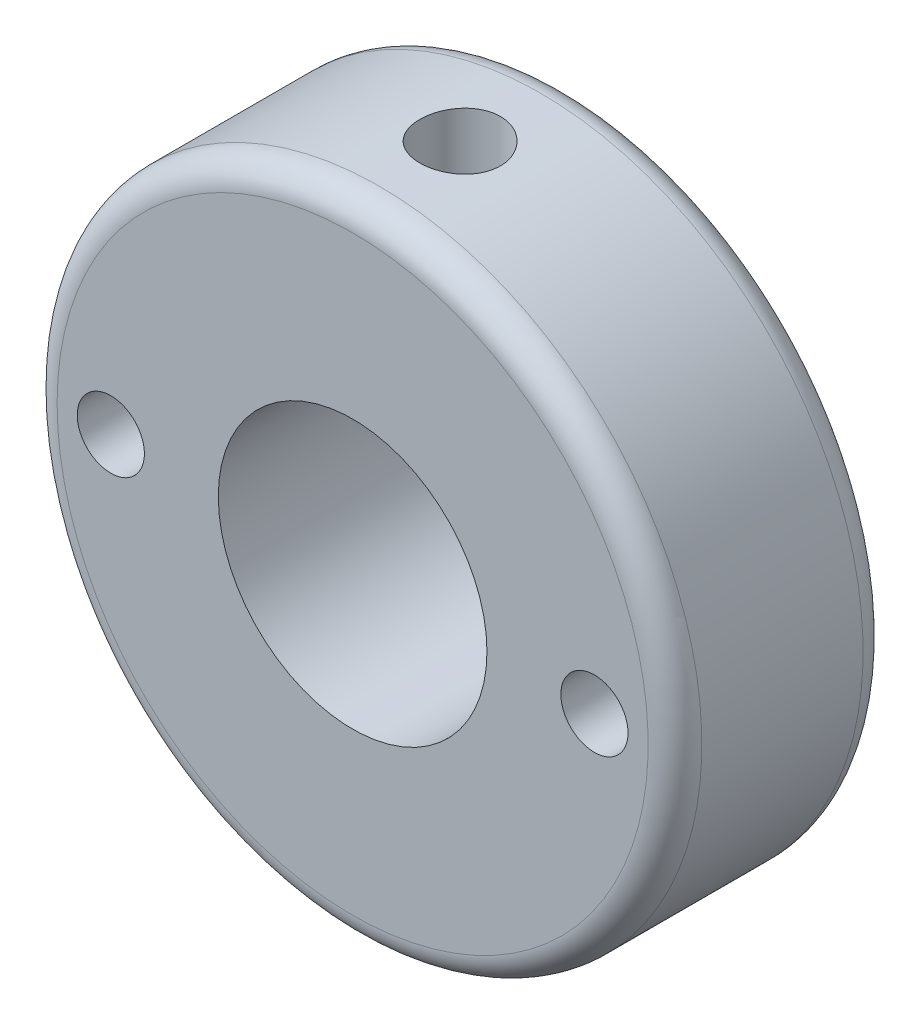
ISO-10303-21;
HEADER;
FILE_DESCRIPTION(('STEP AP214'),'2;1');
FILE_NAME('part.step','',(''),(''),'','','');
FILE_SCHEMA(('AUTOMOTIVE_DESIGN { 1 0 10303 214 1 1 1 1 }'));
ENDSEC;
DATA;
#1=APPLICATION_CONTEXT('core data for automotive mechanical design processes');
#2=APPLICATION_PROTOCOL_DEFINITION('international standard','automotive_design',2000,#1);
#3=PRODUCT_CONTEXT('',#1,'mechanical');
#4=PRODUCT('Part','Part','',(#3));
#5=PRODUCT_RELATED_PRODUCT_CATEGORY('part','',(#4));
#6=PRODUCT_DEFINITION_FORMATION('','',#4);
#7=PRODUCT_DEFINITION_CONTEXT('part definition',#1,'design');
#8=PRODUCT_DEFINITION('design','',#6,#7);
#9=PRODUCT_DEFINITION_SHAPE('','',#8);
#10=(LENGTH_UNIT() NAMED_UNIT(*) SI_UNIT(.MILLI.,.METRE.));
#11=(NAMED_UNIT(*) PLANE_ANGLE_UNIT() SI_UNIT($,.RADIAN.));
#12=(NAMED_UNIT(*) SI_UNIT($,.STERADIAN.) SOLID_ANGLE_UNIT());
#13=UNCERTAINTY_MEASURE_WITH_UNIT(LENGTH_MEASURE(1.E-05),#10,'distance_accuracy_value','');
#14=(GEOMETRIC_REPRESENTATION_CONTEXT(3) GLOBAL_UNCERTAINTY_ASSIGNED_CONTEXT((#13)) GLOBAL_UNIT_ASSIGNED_CONTEXT((#10,
#11,#12)) REPRESENTATION_CONTEXT('',''));
#15=CARTESIAN_POINT('',(0.,0.,0.));
#16=DIRECTION('',(0.,0.,1.));
#17=DIRECTION('',(1.,0.,0.));
#18=AXIS2_PLACEMENT_3D('',#15,#16,#17);
#19=CARTESIAN_POINT('',(0.,0.,0.));
#20=DIRECTION('',(0.,0.,-1.));
#21=DIRECTION('',(-1.,0.,0.));
#22=AXIS2_PLACEMENT_3D('',#19,#20,#21);
#23=PLANE('',#22);
#24=CARTESIAN_POINT('',(0.,0.,0.));
#25=DIRECTION('',(0.,0.,-1.));
#26=DIRECTION('',(-1.,0.,0.));
#27=AXIS2_PLACEMENT_3D('',#24,#25,#26);
#28=CIRCLE('',#27,11.);
#29=CARTESIAN_POINT('',(-11.,0.,0.));
#30=VERTEX_POINT('',#29);
#31=EDGE_CURVE('E50',#30,#30,#28,.T.);
#32=ORIENTED_EDGE('',*,*,#31,.T.);
#33=EDGE_LOOP('',(#32));
#34=FACE_BOUND('',#33,.T.);
#35=CARTESIAN_POINT('',(0.,0.,0.));
#36=DIRECTION('',(0.,0.,-1.));
#37=DIRECTION('',(-1.,0.,0.));
#38=AXIS2_PLACEMENT_3D('',#35,#36,#37);
#39=CIRCLE('',#38,5.);
#40=CARTESIAN_POINT('',(-5.,0.,0.));
#41=VERTEX_POINT('',#40);
#42=EDGE_CURVE('E106',#41,#41,#39,.T.);
#43=ORIENTED_EDGE('',*,*,#42,.F.);
#44=EDGE_LOOP('',(#43));
#45=FACE_BOUND('',#44,.T.);
#46=CARTESIAN_POINT('',(-9.,0.,0.));
#47=DIRECTION('',(0.,0.,1.));
#48=DIRECTION('',(1.,0.,0.));
#49=AXIS2_PLACEMENT_3D('',#46,#47,#48);
#50=CIRCLE('',#49,1.25);
#51=CARTESIAN_POINT('',(-7.75,0.,0.));
#52=VERTEX_POINT('',#51);
#53=EDGE_CURVE('E63',#52,#52,#50,.T.);
#54=ORIENTED_EDGE('',*,*,#53,.T.);
#55=EDGE_LOOP('',(#54));
#56=FACE_BOUND('',#55,.T.);
#57=CARTESIAN_POINT('',(9.,0.,0.));
#58=DIRECTION('',(0.,0.,1.));
#59=DIRECTION('',(1.,0.,0.));
#60=AXIS2_PLACEMENT_3D('',#57,#58,#59);
#61=CIRCLE('',#60,1.25);
#62=CARTESIAN_POINT('',(10.25,0.,0.));
#63=VERTEX_POINT('',#62);
#64=EDGE_CURVE('E115',#63,#63,#61,.T.);
#65=ORIENTED_EDGE('',*,*,#64,.T.);
#66=EDGE_LOOP('',(#65));
#67=FACE_BOUND('',#66,.T.);
#68=ADVANCED_FACE('F35',(#34,#45,#56,#67),#23,.T.);
#69=CARTESIAN_POINT('',(0.,0.,8.));
#70=DIRECTION('',(0.,0.,-1.));
#71=DIRECTION('',(-1.,0.,0.));
#72=AXIS2_PLACEMENT_3D('',#69,#70,#71);
#73=PLANE('',#72);
#74=CARTESIAN_POINT('',(0.,0.,8.));
#75=DIRECTION('',(0.,0.,-1.));
#76=DIRECTION('',(-1.,0.,0.));
#77=AXIS2_PLACEMENT_3D('',#74,#75,#76);
#78=CIRCLE('',#77,11.);
#79=CARTESIAN_POINT('',(-11.,0.,8.));
#80=VERTEX_POINT('',#79);
#81=EDGE_CURVE('E10',#80,#80,#78,.F.);
#82=ORIENTED_EDGE('',*,*,#81,.T.);
#83=EDGE_LOOP('',(#82));
#84=FACE_BOUND('',#83,.T.);
#85=CARTESIAN_POINT('',(0.,0.,8.));
#86=DIRECTION('',(0.,0.,-1.));
#87=DIRECTION('',(-1.,0.,0.));
#88=AXIS2_PLACEMENT_3D('',#85,#86,#87);
#89=CIRCLE('',#88,5.);
#90=CARTESIAN_POINT('',(-5.,0.,8.));
#91=VERTEX_POINT('',#90);
#92=EDGE_CURVE('E109',#91,#91,#89,.T.);
#93=ORIENTED_EDGE('',*,*,#92,.T.);
#94=EDGE_LOOP('',(#93));
#95=FACE_BOUND('',#94,.T.);
#96=CARTESIAN_POINT('',(9.,0.,8.));
#97=DIRECTION('',(0.,0.,1.));
#98=DIRECTION('',(1.,0.,0.));
#99=AXIS2_PLACEMENT_3D('',#96,#97,#98);
#100=CIRCLE('',#99,1.24999999999999);
#101=CARTESIAN_POINT('',(10.25,0.,8.));
#102=VERTEX_POINT('',#101);
#103=EDGE_CURVE('E112',#102,#102,#100,.T.);
#104=ORIENTED_EDGE('',*,*,#103,.F.);
#105=EDGE_LOOP('',(#104));
#106=FACE_BOUND('',#105,.T.);
#107=CARTESIAN_POINT('',(-9.,0.,8.));
#108=DIRECTION('',(0.,0.,1.));
#109=DIRECTION('',(1.,0.,0.));
#110=AXIS2_PLACEMENT_3D('',#107,#108,#109);
#111=CIRCLE('',#110,1.24999999999999);
#112=CARTESIAN_POINT('',(-7.75000000000001,0.,8.));
#113=VERTEX_POINT('',#112);
#114=EDGE_CURVE('E117',#113,#113,#111,.T.);
#115=ORIENTED_EDGE('',*,*,#114,.F.);
#116=EDGE_LOOP('',(#115));
#117=FACE_BOUND('',#116,.T.);
#118=ADVANCED_FACE('F83',(#84,#95,#106,#117),#73,.F.);
#119=CARTESIAN_POINT('',(0.,12.,4.));
#120=DIRECTION('',(0.,1.,0.));
#121=DIRECTION('',(0.,0.,1.));
#122=AXIS2_PLACEMENT_3D('',#119,#120,#121);
#123=CYLINDRICAL_SURFACE('',#122,1.5);
#124=CARTESIAN_POINT('',(0.,5.,5.5));
#125=CARTESIAN_POINT('',(0.0822886127532998,4.9999992925055,5.49999900251511));
#126=CARTESIAN_POINT('',(0.164587318351529,4.99794915693953,5.49320613637603));
#127=CARTESIAN_POINT('',(0.32678812530488,4.98997105593691,5.4662786457779));
#128=CARTESIAN_POINT('',(0.406689504411419,4.98404193389692,5.44614004197666));
#129=CARTESIAN_POINT('',(0.561732707754525,4.96895552501836,5.39325398308973));
#130=CARTESIAN_POINT('',(0.636881364395372,4.95980300250425,5.36052513038106));
#131=CARTESIAN_POINT('',(0.78062418105313,4.93922109237645,5.28346390694416));
#132=CARTESIAN_POINT('',(0.849217467469668,4.92779140192067,5.23912999260458));
#133=CARTESIAN_POINT('',(0.979871797183744,4.90350737192774,5.13877599252733));
#134=CARTESIAN_POINT('',(1.04171807124434,4.89062383657036,5.08248337411408));
#135=CARTESIAN_POINT('',(1.15524920923323,4.86505834210442,4.96039077008981));
#136=CARTESIAN_POINT('',(1.20693236327441,4.85237641724501,4.89458918787504));
#137=CARTESIAN_POINT('',(1.29980037723707,4.82834113993772,4.75352924696239));
#138=CARTESIAN_POINT('',(1.34072309022213,4.81702406663875,4.67809153900926));
#139=CARTESIAN_POINT('',(1.4092139477476,4.79743620394031,4.52101074576971));
#140=CARTESIAN_POINT('',(1.43678529919973,4.78916468313311,4.43936915607202));
#141=CARTESIAN_POINT('',(1.47701633682651,4.77690870838434,4.27460973386954));
#142=CARTESIAN_POINT('',(1.49007196234677,4.77281069324533,4.19159725613606));
#143=CARTESIAN_POINT('',(1.50213730614672,4.76902789749767,4.02446684378323));
#144=CARTESIAN_POINT('',(1.50115042761078,4.76934204760571,3.94034918194091));
#145=CARTESIAN_POINT('',(1.48546977199811,4.77424744067778,3.77661609139152));
#146=CARTESIAN_POINT('',(1.47127205262685,4.7786838859914,3.69694774963776));
#147=CARTESIAN_POINT('',(1.43037420427056,4.79108356228624,3.54118021372654));
#148=CARTESIAN_POINT('',(1.40367284141641,4.79904714132351,3.46508137262567));
#149=CARTESIAN_POINT('',(1.33816026653681,4.81772733074973,3.31739965033926));
#150=CARTESIAN_POINT('',(1.29918816934642,4.82848016115952,3.24589291604474));
#151=CARTESIAN_POINT('',(1.21035222588683,4.85150987000064,3.11026797798981));
#152=CARTESIAN_POINT('',(1.16048574002588,4.86378711746991,3.04615157058622));
#153=CARTESIAN_POINT('',(1.04881290765546,4.88911011297937,2.92431380923798));
#154=CARTESIAN_POINT('',(0.986594907466971,4.90216654310498,2.86697133597033));
#155=CARTESIAN_POINT('',(0.853263259313966,4.92712244063258,2.76344601593575));
#156=CARTESIAN_POINT('',(0.782149051860887,4.9390218351841,2.71726387158558));
#157=CARTESIAN_POINT('',(0.632355038342803,4.9604316006947,2.63714007753527));
#158=CARTESIAN_POINT('',(0.55362774974795,4.96992543668314,2.60328248375014));
#159=CARTESIAN_POINT('',(0.391245415603519,4.98533521832222,2.54940040990037));
#160=CARTESIAN_POINT('',(0.307591751589581,4.99125216186999,2.52937207146751));
#161=CARTESIAN_POINT('',(0.140952242668331,4.99868364643538,2.50434782210061));
#162=CARTESIAN_POINT('',(0.058050097601187,5.0003485041779,2.49883841419839));
#163=CARTESIAN_POINT('',(-0.107499605823383,4.99952923241759,2.50156915571208));
#164=CARTESIAN_POINT('',(-0.19014719669078,4.99704565677756,2.50980746965144));
#165=CARTESIAN_POINT('',(-0.350903605309696,4.98830696987163,2.5393846111115));
#166=CARTESIAN_POINT('',(-0.429072772614169,4.98213829799417,2.56042338758087));
#167=CARTESIAN_POINT('',(-0.580754638954521,4.96674347841532,2.6146432327782));
#168=CARTESIAN_POINT('',(-0.654266777025583,4.95751696321085,2.64782576103786));
#169=CARTESIAN_POINT('',(-0.796437189461051,4.93669654351325,2.72625316548113));
#170=CARTESIAN_POINT('',(-0.864943826199668,4.92505280829675,2.77175934094797));
#171=CARTESIAN_POINT('',(-0.993523307980145,4.90073468764318,2.87322475405281));
#172=CARTESIAN_POINT('',(-1.05359403235593,4.8880600443108,2.92918661188767));
#173=CARTESIAN_POINT('',(-1.16585744551027,4.86253171869138,3.05238730836935));
#174=CARTESIAN_POINT('',(-1.21768481231503,4.84968825033268,3.11996187577174));
#175=CARTESIAN_POINT('',(-1.30928995072153,4.82576515238464,3.26312793901353));
#176=CARTESIAN_POINT('',(-1.34906803829472,4.81468547654651,3.33871922455822));
#177=CARTESIAN_POINT('',(-1.41517347127168,4.79567189615055,3.49553249125469));
#178=CARTESIAN_POINT('',(-1.4415634693705,4.78772337843827,3.57672618653659));
#179=CARTESIAN_POINT('',(-1.48021730815114,4.77591594362794,3.74268796893148));
#180=CARTESIAN_POINT('',(-1.49248598978779,4.772055625083,3.82745482078767));
#181=CARTESIAN_POINT('',(-1.50221984485059,4.76899972496087,3.99436151837623));
#182=CARTESIAN_POINT('',(-1.5002805530849,4.76961647442754,4.07646365101759));
#183=CARTESIAN_POINT('',(-1.48307505444813,4.77499401288294,4.2391141033728));
#184=CARTESIAN_POINT('',(-1.46780938124716,4.77975463592551,4.31966248517635));
#185=CARTESIAN_POINT('',(-1.42476888804136,4.79275763670386,4.47594539914285));
#186=CARTESIAN_POINT('',(-1.39715175507068,4.80095604545965,4.55172728736169));
#187=CARTESIAN_POINT('',(-1.33031507121129,4.81990278909136,4.69764243881772));
#188=CARTESIAN_POINT('',(-1.29109329962876,4.83065161194312,4.76777461764076));
#189=CARTESIAN_POINT('',(-1.20048763805072,4.85397676425833,4.90316311652711));
#190=CARTESIAN_POINT('',(-1.14871276092994,4.86660540163797,4.96814876126041));
#191=CARTESIAN_POINT('',(-1.03517434629782,4.89201320450026,5.08870249830786));
#192=CARTESIAN_POINT('',(-0.973408217134499,4.90479240823905,5.14426813946776));
#193=CARTESIAN_POINT('',(-0.839465762183246,4.92950936570649,5.24602341229503));
#194=CARTESIAN_POINT('',(-0.767037885790605,4.94141159765674,5.29189144685549));
#195=CARTESIAN_POINT('',(-0.615141373983527,4.96260680455813,5.37073516990402));
#196=CARTESIAN_POINT('',(-0.535676052998953,4.97190099931066,5.40371688827451));
#197=CARTESIAN_POINT('',(-0.38075771265528,4.98602174969301,5.45289527565275));
#198=CARTESIAN_POINT('',(-0.305786961954233,4.99122027381067,5.47051167288325));
#199=CARTESIAN_POINT('',(-0.153880195230778,4.99820944494492,5.49406352524158));
#200=CARTESIAN_POINT('',(-0.076944509858139,5.0000006615474,5.50000093270482));
#201=CARTESIAN_POINT('',(0.,5.,5.5));
#202=B_SPLINE_CURVE_WITH_KNOTS('',3,(#124,#125,#126,#127,#128,#129,#130,#131,#132,#133,#134,
#135,#136,#137,#138,#139,#140,#141,#142,#143,#144,#145,#146,#147,#148,#149,#150,#151,#152,#153,
#154,#155,#156,#157,#158,#159,#160,#161,#162,#163,#164,#165,#166,#167,#168,#169,#170,#171,#172,
#173,#174,#175,#176,#177,#178,#179,#180,#181,#182,#183,#184,#185,#186,#187,#188,#189,#190,#191,
#192,#193,#194,#195,#196,#197,#198,#199,#200,#201),.UNSPECIFIED.,.T.,.F.,(4,2,2,2,2,2,2,2,2,2,2,
2,2,2,2,2,2,2,2,2,2,2,2,2,2,2,2,2,2,2,2,2,2,2,2,2,2,2,4),(0.,0.24658320361261,0.493239964845999,
0.739533676300873,0.9858601644127,1.23855602948191,1.49129437288633,1.74971481004109,
2.00807314543223,2.25919689356598,2.51025978319089,2.75226016697676,2.99428443658001,
3.23962426447119,3.48502360158555,3.74067104048166,3.99633456531071,4.25371046881688,
4.51101453528807,4.75908809438544,5.00712853550326,5.24956746682326,5.49203554593728,
5.74011305702907,5.9882528200019,6.24540400322817,6.50254844252679,6.75847814951251,
7.01432009460282,7.25950155466941,7.50467319661599,7.7468004040272,7.98897397553106,
8.23996925679929,8.49102974897501,8.74942996156669,9.00770911595234,9.23831691930458,
9.46888616948873),.UNSPECIFIED.);
#203=CARTESIAN_POINT('',(0.,5.,5.5));
#204=VERTEX_POINT('',#203);
#205=EDGE_CURVE('E100',#204,#204,#202,.T.);
#206=ORIENTED_EDGE('',*,*,#205,.F.);
#207=EDGE_LOOP('',(#206));
#208=FACE_BOUND('',#207,.T.);
#209=CARTESIAN_POINT('',(0.,12.,5.5));
#210=CARTESIAN_POINT('',(-0.0839046573334568,11.9999988293786,5.49999643543857));
#211=CARTESIAN_POINT('',(-0.167861744581648,11.9991107073294,5.49293627249843));
#212=CARTESIAN_POINT('',(-0.333439681253851,11.9956532406682,5.46488334725752));
#213=CARTESIAN_POINT('',(-0.415057998374246,11.9930821406486,5.44387603724596));
#214=CARTESIAN_POINT('',(-0.573537344887832,11.9865483662664,5.38855741365155));
#215=CARTESIAN_POINT('',(-0.650401536087682,11.9825866287333,5.35425505491409));
#216=CARTESIAN_POINT('',(-0.79726768493582,11.9737122052686,5.27333962961812));
#217=CARTESIAN_POINT('',(-0.867270816933821,11.9687996825047,5.22672867488157));
#218=CARTESIAN_POINT('',(-0.998827690158788,11.958541927838,5.12224483009624));
#219=CARTESIAN_POINT('',(-1.06033821896227,11.9531946881545,5.06431772239225));
#220=CARTESIAN_POINT('',(-1.17279167613449,11.9426863560585,4.93896230587801));
#221=CARTESIAN_POINT('',(-1.22373406583535,11.9375252731456,4.87153351305205));
#222=CARTESIAN_POINT('',(-1.31376609677036,11.9279538337175,4.7288080134606));
#223=CARTESIAN_POINT('',(-1.35281525756464,11.9235460630675,4.65348558305923));
#224=CARTESIAN_POINT('',(-1.41769384594507,11.9160067707461,4.49728776883158));
#225=CARTESIAN_POINT('',(-1.44352377483913,11.9128752006788,4.41641259571179));
#226=CARTESIAN_POINT('',(-1.48109938801486,11.9082620376217,4.25185348264794));
#227=CARTESIAN_POINT('',(-1.49291802883902,11.9067719006205,4.16818644537748));
#228=CARTESIAN_POINT('',(-1.50236132973434,11.9055841688568,4.0000442419169));
#229=CARTESIAN_POINT('',(-1.49998656060145,11.9058865020091,3.91556910836123));
#230=CARTESIAN_POINT('',(-1.48117034186874,11.9082417322185,3.74871710365073));
#231=CARTESIAN_POINT('',(-1.46480925779082,11.910284627762,3.66633100827984));
#232=CARTESIAN_POINT('',(-1.41861022990923,11.9158751985458,3.50548298726861));
#233=CARTESIAN_POINT('',(-1.38877201305114,11.9194229042743,3.42702114117158));
#234=CARTESIAN_POINT('',(-1.31637933594699,11.9276346951879,3.27599920058699));
#235=CARTESIAN_POINT('',(-1.27378995222458,11.9323018392687,3.20345601985061));
#236=CARTESIAN_POINT('',(-1.17712888167415,11.9422242685836,3.06651598335205));
#237=CARTESIAN_POINT('',(-1.12305666964846,11.947479580714,3.00211950041579));
#238=CARTESIAN_POINT('',(-1.00451946645227,11.9580306593426,2.88283437356636));
#239=CARTESIAN_POINT('',(-0.939985204704006,11.9633264543213,2.82801454494041));
#240=CARTESIAN_POINT('',(-0.802594301468353,11.9733277953351,2.72997467198167));
#241=CARTESIAN_POINT('',(-0.72973764079095,11.978033340009,2.6867546543968));
#242=CARTESIAN_POINT('',(-0.577717002818088,11.9863269133115,2.61314120772165));
#243=CARTESIAN_POINT('',(-0.498550917202629,11.9899145664092,2.58275208767127));
#244=CARTESIAN_POINT('',(-0.336184764258633,11.9955647146804,2.53571770388605));
#245=CARTESIAN_POINT('',(-0.2529848859784,11.9976272812552,2.51907179671777));
#246=CARTESIAN_POINT('',(-0.0855078983480985,11.9999855784646,2.50008554544367));
#247=CARTESIAN_POINT('',(-0.00124169411916431,12.0002930168558,2.49765040458156));
#248=CARTESIAN_POINT('',(0.166497621898497,11.9991380280326,2.50690464043357));
#249=CARTESIAN_POINT('',(0.249970750538823,11.9976756385093,2.51859371635096));
#250=CARTESIAN_POINT('',(0.413474704632912,11.9931526125402,2.55568582526463));
#251=CARTESIAN_POINT('',(0.493515942254822,11.9900972448832,2.58104365804158));
#252=CARTESIAN_POINT('',(0.648209792915042,11.9827303386012,2.64470647114775));
#253=CARTESIAN_POINT('',(0.722862222879187,11.9784187573237,2.68301189109486));
#254=CARTESIAN_POINT('',(0.865082712412454,11.9689909374607,2.77171188250448));
#255=CARTESIAN_POINT('',(0.93261225596629,11.9638706642551,2.82216777388338));
#256=CARTESIAN_POINT('',(1.05827819377579,11.9534108539539,2.93364969852052));
#257=CARTESIAN_POINT('',(1.11641421500211,11.9480713081614,2.9946761513506));
#258=CARTESIAN_POINT('',(1.22197917529081,11.9377386327755,3.12598445005428));
#259=CARTESIAN_POINT('',(1.26934527634076,11.932747648328,3.19631700778624));
#260=CARTESIAN_POINT('',(1.3515917336661,11.9237124662229,3.34399494691283));
#261=CARTESIAN_POINT('',(1.38647234023702,11.9196682495862,3.42134018768591));
#262=CARTESIAN_POINT('',(1.44265594731992,11.912999102358,3.58064519148857));
#263=CARTESIAN_POINT('',(1.46399437647426,11.9103704711087,3.66259229802878));
#264=CARTESIAN_POINT('',(1.49260199632071,11.9068194954447,3.8289414902684));
#265=CARTESIAN_POINT('',(1.49987184152146,11.9058970716527,3.9133434615754));
#266=CARTESIAN_POINT('',(1.5001239216509,11.9058652618947,4.08158135752281));
#267=CARTESIAN_POINT('',(1.49320487861956,11.9067433485117,4.16541714899913));
#268=CARTESIAN_POINT('',(1.46548464290959,11.9101866872232,4.33072427760705));
#269=CARTESIAN_POINT('',(1.44468344874346,11.9127519394985,4.41219561448528));
#270=CARTESIAN_POINT('',(1.38982024421379,11.9192766946473,4.57044817405984));
#271=CARTESIAN_POINT('',(1.35576298858256,11.9232356975567,4.64723106701309));
#272=CARTESIAN_POINT('',(1.27536414129018,11.9321026994689,4.79400799242899));
#273=CARTESIAN_POINT('',(1.22902239570575,11.9370107103625,4.8640019398119));
#274=CARTESIAN_POINT('',(1.1250037987595,11.9472636285134,4.99571873520428));
#275=CARTESIAN_POINT('',(1.06725337546497,11.9526112325042,5.05738327657299));
#276=CARTESIAN_POINT('',(0.942210136181028,11.9631169895574,5.17018409510078));
#277=CARTESIAN_POINT('',(0.874915073484939,11.9682750976535,5.22131788646459));
#278=CARTESIAN_POINT('',(0.732399372512525,11.9778423395205,5.31177121426317));
#279=CARTESIAN_POINT('',(0.6571495677577,11.9822485504698,5.35104508353955));
#280=CARTESIAN_POINT('',(0.501109741380767,11.9897858944604,5.41634274574977));
#281=CARTESIAN_POINT('',(0.420325848522141,11.9929184122175,5.44238093581207));
#282=CARTESIAN_POINT('',(0.282603463180754,11.9968003219665,5.47423560290278));
#283=CARTESIAN_POINT('',(0.226533398110152,11.9979943553727,5.48388336518924));
#284=CARTESIAN_POINT('',(0.113650237927461,11.9995945879751,5.49676674741593));
#285=CARTESIAN_POINT('',(0.0568371482976163,12.0000007929808,5.50000241463958));
#286=CARTESIAN_POINT('',(0.,12.,5.5));
#287=B_SPLINE_CURVE_WITH_KNOTS('',3,(#209,#210,#211,#212,#213,#214,#215,#216,#217,#218,#219,
#220,#221,#222,#223,#224,#225,#226,#227,#228,#229,#230,#231,#232,#233,#234,#235,#236,#237,#238,
#239,#240,#241,#242,#243,#244,#245,#246,#247,#248,#249,#250,#251,#252,#253,#254,#255,#256,#257,
#258,#259,#260,#261,#262,#263,#264,#265,#266,#267,#268,#269,#270,#271,#272,#273,#274,#275,#276,
#277,#278,#279,#280,#281,#282,#283,#284,#285,#286),.UNSPECIFIED.,.T.,.F.,(4,2,2,2,2,2,2,2,2,2,2,
2,2,2,2,2,2,2,2,2,2,2,2,2,2,2,2,2,2,2,2,2,2,2,2,2,2,2,4),(0.,0.251506363665748,
0.503275476566055,0.754875304909061,1.00643199354644,1.25922487921106,1.51203064680006,
1.76568750191321,2.01933473698084,2.27165535171792,2.52396581930798,2.77483617865015,
3.02571162099744,3.27728055771319,3.52886100308182,3.78218086881849,4.03550131867867,
4.28890677438962,4.54230036542267,4.79400167635152,5.04569762701156,5.29656632336037,
5.54744353847368,5.79961441757052,6.05179530825052,6.30541182904543,6.55902326532922,
6.81196844568554,7.06490185806373,7.31608140721328,7.56726098327728,7.81835054823891,
8.06944325947357,8.32221142615097,8.57503919082006,8.82882841822111,9.08234099210418,
9.25271305912576,9.42308386980261),.UNSPECIFIED.);
#288=CARTESIAN_POINT('',(0.,12.,5.5));
#289=VERTEX_POINT('',#288);
#290=EDGE_CURVE('E55',#289,#289,#287,.T.);
#291=ORIENTED_EDGE('',*,*,#290,.F.);
#292=EDGE_LOOP('',(#291));
#293=FACE_BOUND('',#292,.T.);
#294=ADVANCED_FACE('F65',(#208,#293),#123,.F.);
#295=CARTESIAN_POINT('',(-9.,0.,8.));
#296=DIRECTION('',(0.,0.,1.));
#297=DIRECTION('',(1.,0.,0.));
#298=AXIS2_PLACEMENT_3D('',#295,#296,#297);
#299=CYLINDRICAL_SURFACE('',#298,1.24999999999999);
#300=ORIENTED_EDGE('',*,*,#53,.F.);
#301=EDGE_LOOP('',(#300));
#302=FACE_BOUND('',#301,.T.);
#303=ORIENTED_EDGE('',*,*,#114,.T.);
#304=EDGE_LOOP('',(#303));
#305=FACE_BOUND('',#304,.T.);
#306=ADVANCED_FACE('F92',(#302,#305),#299,.F.);
#307=CARTESIAN_POINT('',(9.,0.,8.));
#308=DIRECTION('',(0.,0.,1.));
#309=DIRECTION('',(1.,0.,0.));
#310=AXIS2_PLACEMENT_3D('',#307,#308,#309);
#311=CYLINDRICAL_SURFACE('',#310,1.24999999999999);
#312=ORIENTED_EDGE('',*,*,#64,.F.);
#313=EDGE_LOOP('',(#312));
#314=FACE_BOUND('',#313,.T.);
#315=ORIENTED_EDGE('',*,*,#103,.T.);
#316=EDGE_LOOP('',(#315));
#317=FACE_BOUND('',#316,.T.);
#318=ADVANCED_FACE('F78',(#314,#317),#311,.F.);
#319=CARTESIAN_POINT('',(0.,0.,0.));
#320=DIRECTION('',(0.,0.,-1.));
#321=DIRECTION('',(-1.,0.,0.));
#322=AXIS2_PLACEMENT_3D('',#319,#320,#321);
#323=CYLINDRICAL_SURFACE('',#322,5.);
#324=ORIENTED_EDGE('',*,*,#205,.T.);
#325=EDGE_LOOP('',(#324));
#326=FACE_BOUND('',#325,.T.);
#327=ORIENTED_EDGE('',*,*,#92,.F.);
#328=EDGE_LOOP('',(#327));
#329=FACE_BOUND('',#328,.T.);
#330=ORIENTED_EDGE('',*,*,#42,.T.);
#331=EDGE_LOOP('',(#330));
#332=FACE_BOUND('',#331,.T.);
#333=ADVANCED_FACE('F72',(#326,#329,#332),#323,.F.);
#334=CARTESIAN_POINT('',(0.,0.,-2.));
#335=DIRECTION('',(0.,0.,1.));
#336=DIRECTION('',(1.,0.,0.));
#337=AXIS2_PLACEMENT_3D('',#334,#335,#336);
#338=CYLINDRICAL_SURFACE('',#337,12.);
#339=CARTESIAN_POINT('',(0.,0.,1.));
#340=DIRECTION('',(0.,0.,-1.));
#341=DIRECTION('',(-1.,0.,0.));
#342=AXIS2_PLACEMENT_3D('',#339,#340,#341);
#343=CIRCLE('',#342,12.);
#344=CARTESIAN_POINT('',(-12.,0.,1.));
#345=VERTEX_POINT('',#344);
#346=EDGE_CURVE('E42',#345,#345,#343,.F.);
#347=ORIENTED_EDGE('',*,*,#346,.T.);
#348=EDGE_LOOP('',(#347));
#349=FACE_BOUND('',#348,.T.);
#350=CARTESIAN_POINT('',(0.,0.,7.));
#351=DIRECTION('',(0.,0.,-1.));
#352=DIRECTION('',(-1.,0.,0.));
#353=AXIS2_PLACEMENT_3D('',#350,#351,#352);
#354=CIRCLE('',#353,12.);
#355=CARTESIAN_POINT('',(-12.,0.,7.));
#356=VERTEX_POINT('',#355);
#357=EDGE_CURVE('E46',#356,#356,#354,.T.);
#358=ORIENTED_EDGE('',*,*,#357,.T.);
#359=EDGE_LOOP('',(#358));
#360=FACE_BOUND('',#359,.T.);
#361=ORIENTED_EDGE('',*,*,#290,.T.);
#362=EDGE_LOOP('',(#361));
#363=FACE_BOUND('',#362,.T.);
#364=ADVANCED_FACE('F68',(#349,#360,#363),#338,.T.);
#365=CARTESIAN_POINT('',(0.,0.,1.));
#366=DIRECTION('',(0.,0.,-1.));
#367=DIRECTION('',(-1.,0.,0.));
#368=AXIS2_PLACEMENT_3D('',#365,#366,#367);
#369=TOROIDAL_SURFACE('',#368,11.,1.);
#370=ORIENTED_EDGE('',*,*,#346,.F.);
#371=EDGE_LOOP('',(#370));
#372=FACE_BOUND('',#371,.T.);
#373=ORIENTED_EDGE('',*,*,#31,.F.);
#374=EDGE_LOOP('',(#373));
#375=FACE_BOUND('',#374,.T.);
#376=ADVANCED_FACE('F71',(#372,#375),#369,.T.);
#377=CARTESIAN_POINT('',(0.,0.,7.));
#378=DIRECTION('',(0.,0.,-1.));
#379=DIRECTION('',(-1.,0.,0.));
#380=AXIS2_PLACEMENT_3D('',#377,#378,#379);
#381=TOROIDAL_SURFACE('',#380,11.,1.);
#382=ORIENTED_EDGE('',*,*,#357,.F.);
#383=EDGE_LOOP('',(#382));
#384=FACE_BOUND('',#383,.T.);
#385=ORIENTED_EDGE('',*,*,#81,.F.);
#386=EDGE_LOOP('',(#385));
#387=FACE_BOUND('',#386,.T.);
#388=ADVANCED_FACE('F37',(#384,#387),#381,.T.);
#389=CLOSED_SHELL('',(#68,#118,#294,#306,#318,#333,#364,#376,#388));
#390=MANIFOLD_SOLID_BREP('B2',#389);
#391=ADVANCED_BREP_SHAPE_REPRESENTATION('',(#18,#390),#14);
#392=SHAPE_DEFINITION_REPRESENTATION(#9,#391);
ENDSEC;
END-ISO-10303-21;
